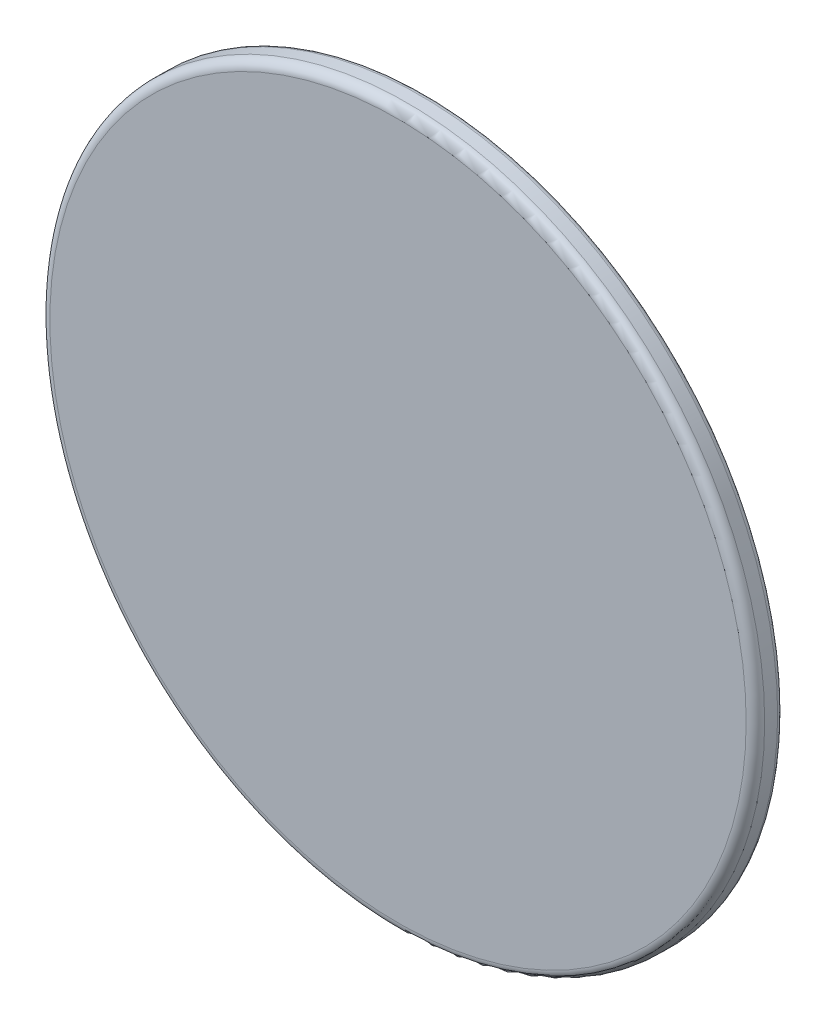
ISO-10303-21;
HEADER;
FILE_DESCRIPTION(('STEP AP214'),'2;1');
FILE_NAME('part.step','',(''),(''),'','','');
FILE_SCHEMA(('AUTOMOTIVE_DESIGN { 1 0 10303 214 1 1 1 1 }'));
ENDSEC;
DATA;
#1=APPLICATION_CONTEXT('core data for automotive mechanical design processes');
#2=APPLICATION_PROTOCOL_DEFINITION('international standard','automotive_design',2000,#1);
#3=PRODUCT_CONTEXT('',#1,'mechanical');
#4=PRODUCT('Part','Part','',(#3));
#5=PRODUCT_RELATED_PRODUCT_CATEGORY('part','',(#4));
#6=PRODUCT_DEFINITION_FORMATION('','',#4);
#7=PRODUCT_DEFINITION_CONTEXT('part definition',#1,'design');
#8=PRODUCT_DEFINITION('design','',#6,#7);
#9=PRODUCT_DEFINITION_SHAPE('','',#8);
#10=(LENGTH_UNIT() NAMED_UNIT(*) SI_UNIT(.MILLI.,.METRE.));
#11=(NAMED_UNIT(*) PLANE_ANGLE_UNIT() SI_UNIT($,.RADIAN.));
#12=(NAMED_UNIT(*) SI_UNIT($,.STERADIAN.) SOLID_ANGLE_UNIT());
#13=UNCERTAINTY_MEASURE_WITH_UNIT(LENGTH_MEASURE(1.E-05),#10,'distance_accuracy_value','');
#14=(GEOMETRIC_REPRESENTATION_CONTEXT(3) GLOBAL_UNCERTAINTY_ASSIGNED_CONTEXT((#13)) GLOBAL_UNIT_ASSIGNED_CONTEXT((#10,
#11,#12)) REPRESENTATION_CONTEXT('',''));
#15=CARTESIAN_POINT('',(0.,0.,0.));
#16=DIRECTION('',(0.,0.,1.));
#17=DIRECTION('',(1.,0.,0.));
#18=AXIS2_PLACEMENT_3D('',#15,#16,#17);
#19=CARTESIAN_POINT('',(0.,0.,1.5));
#20=DIRECTION('',(0.,0.,-1.));
#21=DIRECTION('',(-1.,0.,0.));
#22=AXIS2_PLACEMENT_3D('',#19,#20,#21);
#23=CYLINDRICAL_SURFACE('',#22,19.3);
#24=CARTESIAN_POINT('',(0.,0.,0.3));
#25=DIRECTION('',(0.,0.,1.));
#26=DIRECTION('',(1.,0.,0.));
#27=AXIS2_PLACEMENT_3D('',#24,#25,#26);
#28=CIRCLE('',#27,19.3);
#29=CARTESIAN_POINT('',(19.3,0.,0.3));
#30=VERTEX_POINT('',#29);
#31=EDGE_CURVE('E37',#30,#30,#28,.T.);
#32=ORIENTED_EDGE('',*,*,#31,.T.);
#33=EDGE_LOOP('',(#32));
#34=FACE_BOUND('',#33,.T.);
#35=CARTESIAN_POINT('',(0.,0.,1.));
#36=DIRECTION('',(0.,0.,1.));
#37=DIRECTION('',(1.,0.,0.));
#38=AXIS2_PLACEMENT_3D('',#35,#36,#37);
#39=CIRCLE('',#38,19.3);
#40=CARTESIAN_POINT('',(19.3,0.,1.));
#41=VERTEX_POINT('',#40);
#42=EDGE_CURVE('E41',#41,#41,#39,.F.);
#43=ORIENTED_EDGE('',*,*,#42,.T.);
#44=EDGE_LOOP('',(#43));
#45=FACE_BOUND('',#44,.T.);
#46=ADVANCED_FACE('F30',(#34,#45),#23,.T.);
#47=CARTESIAN_POINT('',(0.,0.,1.5));
#48=DIRECTION('',(0.,0.,1.));
#49=DIRECTION('',(1.,0.,0.));
#50=AXIS2_PLACEMENT_3D('',#47,#48,#49);
#51=PLANE('',#50);
#52=CARTESIAN_POINT('',(0.,0.,1.5));
#53=DIRECTION('',(0.,0.,1.));
#54=DIRECTION('',(1.,0.,0.));
#55=AXIS2_PLACEMENT_3D('',#52,#53,#54);
#56=CIRCLE('',#55,18.8);
#57=CARTESIAN_POINT('',(18.8,0.,1.5));
#58=VERTEX_POINT('',#57);
#59=EDGE_CURVE('E45',#58,#58,#56,.T.);
#60=ORIENTED_EDGE('',*,*,#59,.T.);
#61=EDGE_LOOP('',(#60));
#62=FACE_BOUND('',#61,.T.);
#63=ADVANCED_FACE('F67',(#62),#51,.T.);
#64=CARTESIAN_POINT('',(0.,0.,0.));
#65=DIRECTION('',(0.,0.,1.));
#66=DIRECTION('',(1.,0.,0.));
#67=AXIS2_PLACEMENT_3D('',#64,#65,#66);
#68=PLANE('',#67);
#69=CARTESIAN_POINT('',(0.,0.,0.));
#70=DIRECTION('',(0.,0.,1.));
#71=DIRECTION('',(1.,0.,0.));
#72=AXIS2_PLACEMENT_3D('',#69,#70,#71);
#73=CIRCLE('',#72,19.);
#74=CARTESIAN_POINT('',(19.,0.,0.));
#75=VERTEX_POINT('',#74);
#76=EDGE_CURVE('E10',#75,#75,#73,.F.);
#77=ORIENTED_EDGE('',*,*,#76,.T.);
#78=EDGE_LOOP('',(#77));
#79=FACE_BOUND('',#78,.T.);
#80=CARTESIAN_POINT('',(0.,0.,0.));
#81=DIRECTION('',(0.,0.,-1.));
#82=DIRECTION('',(-1.,0.,0.));
#83=AXIS2_PLACEMENT_3D('',#80,#81,#82);
#84=CIRCLE('',#83,18.);
#85=CARTESIAN_POINT('',(-18.,0.,0.));
#86=VERTEX_POINT('',#85);
#87=EDGE_CURVE('E51',#86,#86,#84,.T.);
#88=ORIENTED_EDGE('',*,*,#87,.F.);
#89=EDGE_LOOP('',(#88));
#90=FACE_BOUND('',#89,.T.);
#91=ADVANCED_FACE('F62',(#79,#90),#68,.F.);
#92=CARTESIAN_POINT('',(0.,0.,1.));
#93=DIRECTION('',(0.,0.,-1.));
#94=DIRECTION('',(-1.,0.,0.));
#95=AXIS2_PLACEMENT_3D('',#92,#93,#94);
#96=CYLINDRICAL_SURFACE('',#95,18.);
#97=CARTESIAN_POINT('',(0.,0.,1.));
#98=DIRECTION('',(0.,0.,-1.));
#99=DIRECTION('',(-1.,0.,0.));
#100=AXIS2_PLACEMENT_3D('',#97,#98,#99);
#101=CIRCLE('',#100,18.);
#102=CARTESIAN_POINT('',(-18.,0.,1.));
#103=VERTEX_POINT('',#102);
#104=EDGE_CURVE('E50',#103,#103,#101,.T.);
#105=ORIENTED_EDGE('',*,*,#104,.F.);
#106=EDGE_LOOP('',(#105));
#107=FACE_BOUND('',#106,.T.);
#108=ORIENTED_EDGE('',*,*,#87,.T.);
#109=EDGE_LOOP('',(#108));
#110=FACE_BOUND('',#109,.T.);
#111=ADVANCED_FACE('F59',(#107,#110),#96,.F.);
#112=CARTESIAN_POINT('',(0.,0.,1.));
#113=DIRECTION('',(0.,0.,-1.));
#114=DIRECTION('',(-1.,0.,0.));
#115=AXIS2_PLACEMENT_3D('',#112,#113,#114);
#116=PLANE('',#115);
#117=ORIENTED_EDGE('',*,*,#104,.T.);
#118=EDGE_LOOP('',(#117));
#119=FACE_BOUND('',#118,.T.);
#120=ADVANCED_FACE('F57',(#119),#116,.T.);
#121=CARTESIAN_POINT('',(0.,0.,1.));
#122=DIRECTION('',(0.,0.,1.));
#123=DIRECTION('',(1.,0.,0.));
#124=AXIS2_PLACEMENT_3D('',#121,#122,#123);
#125=TOROIDAL_SURFACE('',#124,18.8,0.5);
#126=ORIENTED_EDGE('',*,*,#42,.F.);
#127=EDGE_LOOP('',(#126));
#128=FACE_BOUND('',#127,.T.);
#129=ORIENTED_EDGE('',*,*,#59,.F.);
#130=EDGE_LOOP('',(#129));
#131=FACE_BOUND('',#130,.T.);
#132=ADVANCED_FACE('F79',(#128,#131),#125,.T.);
#133=CARTESIAN_POINT('',(0.,0.,0.3));
#134=DIRECTION('',(0.,0.,1.));
#135=DIRECTION('',(1.,0.,0.));
#136=AXIS2_PLACEMENT_3D('',#133,#134,#135);
#137=TOROIDAL_SURFACE('',#136,19.,0.3);
#138=ORIENTED_EDGE('',*,*,#76,.F.);
#139=EDGE_LOOP('',(#138));
#140=FACE_BOUND('',#139,.T.);
#141=ORIENTED_EDGE('',*,*,#31,.F.);
#142=EDGE_LOOP('',(#141));
#143=FACE_BOUND('',#142,.T.);
#144=ADVANCED_FACE('F32',(#140,#143),#137,.T.);
#145=CLOSED_SHELL('',(#46,#63,#91,#111,#120,#132,#144));
#146=MANIFOLD_SOLID_BREP('B2',#145);
#147=ADVANCED_BREP_SHAPE_REPRESENTATION('',(#18,#146),#14);
#148=SHAPE_DEFINITION_REPRESENTATION(#9,#147);
ENDSEC;
END-ISO-10303-21;
